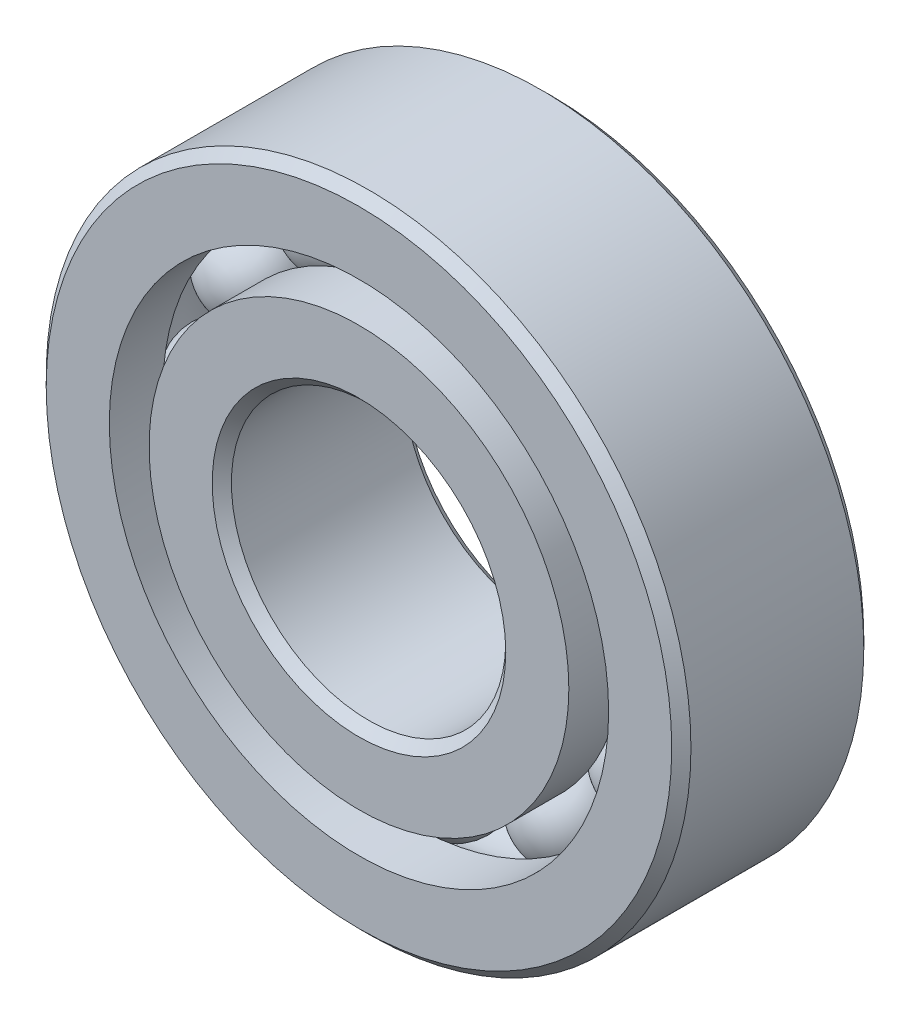
ISO-10303-21;
HEADER;
FILE_DESCRIPTION(('STEP AP214'),'2;1');
FILE_NAME('part.step','',(''),(''),'','','');
FILE_SCHEMA(('AUTOMOTIVE_DESIGN { 1 0 10303 214 1 1 1 1 }'));
ENDSEC;
DATA;
#1=APPLICATION_CONTEXT('core data for automotive mechanical design processes');
#2=APPLICATION_PROTOCOL_DEFINITION('international standard','automotive_design',2000,#1);
#3=PRODUCT_CONTEXT('',#1,'mechanical');
#4=PRODUCT('Part','Part','',(#3));
#5=PRODUCT_RELATED_PRODUCT_CATEGORY('part','',(#4));
#6=PRODUCT_DEFINITION_FORMATION('','',#4);
#7=PRODUCT_DEFINITION_CONTEXT('part definition',#1,'design');
#8=PRODUCT_DEFINITION('design','',#6,#7);
#9=PRODUCT_DEFINITION_SHAPE('','',#8);
#10=(LENGTH_UNIT() NAMED_UNIT(*) SI_UNIT(.MILLI.,.METRE.));
#11=(NAMED_UNIT(*) PLANE_ANGLE_UNIT() SI_UNIT($,.RADIAN.));
#12=(NAMED_UNIT(*) SI_UNIT($,.STERADIAN.) SOLID_ANGLE_UNIT());
#13=UNCERTAINTY_MEASURE_WITH_UNIT(LENGTH_MEASURE(1.E-05),#10,'distance_accuracy_value','');
#14=(GEOMETRIC_REPRESENTATION_CONTEXT(3) GLOBAL_UNCERTAINTY_ASSIGNED_CONTEXT((#13)) GLOBAL_UNIT_ASSIGNED_CONTEXT((#10,
#11,#12)) REPRESENTATION_CONTEXT('',''));
#15=CARTESIAN_POINT('',(0.,0.,0.));
#16=DIRECTION('',(0.,0.,1.));
#17=DIRECTION('',(1.,0.,0.));
#18=AXIS2_PLACEMENT_3D('',#15,#16,#17);
#19=CARTESIAN_POINT('',(-8.37499999999982,14.5059255133895,0.));
#20=DIRECTION('',(0.,0.,1.));
#21=DIRECTION('',(-0.499999999999989,0.866025403784445,0.));
#22=AXIS2_PLACEMENT_3D('',#19,#20,#21);
#23=SPHERICAL_SURFACE('',#22,3.43265291781274);
#24=CARTESIAN_POINT('',(-8.37499999999982,14.5059255133895,3.43265291781274));
#25=VERTEX_POINT('',#24);
#26=VERTEX_LOOP('',#25);
#27=FACE_BOUND('',#26,.T.);
#28=ADVANCED_FACE('F39',(#27),#23,.T.);
#29=CLOSED_SHELL('',(#28));
#30=MANIFOLD_SOLID_BREP('B2',#29);
#31=CARTESIAN_POINT('',(-14.5059255133893,8.37500000000017,0.));
#32=DIRECTION('',(0.,0.,1.));
#33=DIRECTION('',(-0.866025403784433,0.50000000000001,0.));
#34=AXIS2_PLACEMENT_3D('',#31,#32,#33);
#35=SPHERICAL_SURFACE('',#34,3.43265291781274);
#36=CARTESIAN_POINT('',(-14.5059255133893,8.37500000000017,3.43265291781274));
#37=VERTEX_POINT('',#36);
#38=VERTEX_LOOP('',#37);
#39=FACE_BOUND('',#38,.T.);
#40=ADVANCED_FACE('F59',(#39),#35,.T.);
#41=CLOSED_SHELL('',(#40));
#42=MANIFOLD_SOLID_BREP('B6',#41);
#43=CARTESIAN_POINT('',(-16.75,1.75446937276867E-13,0.));
#44=DIRECTION('',(0.,0.,1.));
#45=DIRECTION('',(-1.,0.,0.));
#46=AXIS2_PLACEMENT_3D('',#43,#44,#45);
#47=SPHERICAL_SURFACE('',#46,3.43265291781274);
#48=CARTESIAN_POINT('',(-16.75,1.75446937276867E-13,3.43265291781274));
#49=VERTEX_POINT('',#48);
#50=VERTEX_LOOP('',#49);
#51=FACE_BOUND('',#50,.T.);
#52=ADVANCED_FACE('F79',(#51),#47,.T.);
#53=CLOSED_SHELL('',(#52));
#54=MANIFOLD_SOLID_BREP('B35',#53);
#55=CARTESIAN_POINT('',(-14.5059255133894,-8.37499999999986,0.));
#56=DIRECTION('',(0.,0.,1.));
#57=DIRECTION('',(-0.866025403784443,-0.499999999999992,0.));
#58=AXIS2_PLACEMENT_3D('',#55,#56,#57);
#59=SPHERICAL_SURFACE('',#58,3.43265291781274);
#60=CARTESIAN_POINT('',(-14.5059255133894,-8.37499999999986,3.43265291781274));
#61=VERTEX_POINT('',#60);
#62=VERTEX_LOOP('',#61);
#63=FACE_BOUND('',#62,.T.);
#64=ADVANCED_FACE('F99',(#63),#59,.T.);
#65=CLOSED_SHELL('',(#64));
#66=MANIFOLD_SOLID_BREP('B55',#65);
#67=CARTESIAN_POINT('',(-8.37500000000012,-14.5059255133893,0.));
#68=DIRECTION('',(0.,0.,1.));
#69=DIRECTION('',(-0.500000000000007,-0.866025403784435,0.));
#70=AXIS2_PLACEMENT_3D('',#67,#68,#69);
#71=SPHERICAL_SURFACE('',#70,3.43265291781274);
#72=CARTESIAN_POINT('',(-8.37500000000012,-14.5059255133893,3.43265291781274));
#73=VERTEX_POINT('',#72);
#74=VERTEX_LOOP('',#73);
#75=FACE_BOUND('',#74,.T.);
#76=ADVANCED_FACE('F119',(#75),#71,.T.);
#77=CLOSED_SHELL('',(#76));
#78=MANIFOLD_SOLID_BREP('B75',#77);
#79=CARTESIAN_POINT('',(-1.16964624851245E-13,-16.75,0.));
#80=DIRECTION('',(0.,0.,1.));
#81=DIRECTION('',(0.,-1.,0.));
#82=AXIS2_PLACEMENT_3D('',#79,#80,#81);
#83=SPHERICAL_SURFACE('',#82,3.43265291781274);
#84=CARTESIAN_POINT('',(-1.16964624851245E-13,-16.75,3.43265291781274));
#85=VERTEX_POINT('',#84);
#86=VERTEX_LOOP('',#85);
#87=FACE_BOUND('',#86,.T.);
#88=ADVANCED_FACE('F139',(#87),#83,.T.);
#89=CLOSED_SHELL('',(#88));
#90=MANIFOLD_SOLID_BREP('B95',#89);
#91=CARTESIAN_POINT('',(8.37499999999991,-14.5059255133894,0.));
#92=DIRECTION('',(0.,0.,1.));
#93=DIRECTION('',(0.499999999999995,-0.866025403784442,0.));
#94=AXIS2_PLACEMENT_3D('',#91,#92,#93);
#95=SPHERICAL_SURFACE('',#94,3.43265291781274);
#96=CARTESIAN_POINT('',(8.37499999999991,-14.5059255133894,3.43265291781274));
#97=VERTEX_POINT('',#96);
#98=VERTEX_LOOP('',#97);
#99=FACE_BOUND('',#98,.T.);
#100=ADVANCED_FACE('F159',(#99),#95,.T.);
#101=CLOSED_SHELL('',(#100));
#102=MANIFOLD_SOLID_BREP('B115',#101);
#103=CARTESIAN_POINT('',(14.5059255133893,-8.37500000000007,0.));
#104=DIRECTION('',(0.,0.,1.));
#105=DIRECTION('',(0.866025403784436,-0.500000000000004,0.));
#106=AXIS2_PLACEMENT_3D('',#103,#104,#105);
#107=SPHERICAL_SURFACE('',#106,3.43265291781274);
#108=CARTESIAN_POINT('',(14.5059255133893,-8.37500000000007,3.43265291781274));
#109=VERTEX_POINT('',#108);
#110=VERTEX_LOOP('',#109);
#111=FACE_BOUND('',#110,.T.);
#112=ADVANCED_FACE('F179',(#111),#107,.T.);
#113=CLOSED_SHELL('',(#112));
#114=MANIFOLD_SOLID_BREP('B135',#113);
#115=CARTESIAN_POINT('',(16.75,0.,0.));
#116=DIRECTION('',(0.,0.,1.));
#117=DIRECTION('',(1.,0.,0.));
#118=AXIS2_PLACEMENT_3D('',#115,#116,#117);
#119=SPHERICAL_SURFACE('',#118,3.43265291781274);
#120=CARTESIAN_POINT('',(16.75,0.,3.43265291781274));
#121=VERTEX_POINT('',#120);
#122=VERTEX_LOOP('',#121);
#123=FACE_BOUND('',#122,.T.);
#124=ADVANCED_FACE('F199',(#123),#119,.T.);
#125=CLOSED_SHELL('',(#124));
#126=MANIFOLD_SOLID_BREP('B155',#125);
#127=CARTESIAN_POINT('',(14.5059255133894,8.37499999999997,0.));
#128=DIRECTION('',(0.,0.,1.));
#129=DIRECTION('',(0.86602540378444,0.499999999999998,0.));
#130=AXIS2_PLACEMENT_3D('',#127,#128,#129);
#131=SPHERICAL_SURFACE('',#130,3.43265291781274);
#132=CARTESIAN_POINT('',(14.5059255133894,8.37499999999997,3.43265291781274));
#133=VERTEX_POINT('',#132);
#134=VERTEX_LOOP('',#133);
#135=FACE_BOUND('',#134,.T.);
#136=ADVANCED_FACE('F219',(#135),#131,.T.);
#137=CLOSED_SHELL('',(#136));
#138=MANIFOLD_SOLID_BREP('B175',#137);
#139=CARTESIAN_POINT('',(8.37500000000002,14.5059255133893,0.));
#140=DIRECTION('',(0.,0.,1.));
#141=DIRECTION('',(0.500000000000001,0.866025403784438,0.));
#142=AXIS2_PLACEMENT_3D('',#139,#140,#141);
#143=SPHERICAL_SURFACE('',#142,3.43265291781274);
#144=CARTESIAN_POINT('',(8.37500000000002,14.5059255133893,3.43265291781274));
#145=VERTEX_POINT('',#144);
#146=VERTEX_LOOP('',#145);
#147=FACE_BOUND('',#146,.T.);
#148=ADVANCED_FACE('F239',(#147),#143,.T.);
#149=CLOSED_SHELL('',(#148));
#150=MANIFOLD_SOLID_BREP('B195',#149);
#151=CARTESIAN_POINT('',(0.,16.75,0.));
#152=DIRECTION('',(0.,0.,1.));
#153=DIRECTION('',(0.,1.,0.));
#154=AXIS2_PLACEMENT_3D('',#151,#152,#153);
#155=SPHERICAL_SURFACE('',#154,3.43265291781274);
#156=CARTESIAN_POINT('',(0.,16.75,3.43265291781274));
#157=VERTEX_POINT('',#156);
#158=VERTEX_LOOP('',#157);
#159=FACE_BOUND('',#158,.T.);
#160=ADVANCED_FACE('F261',(#159),#155,.T.);
#161=CLOSED_SHELL('',(#160));
#162=MANIFOLD_SOLID_BREP('B215',#161);
#163=CARTESIAN_POINT('',(0.,15.2994505494506,7.));
#164=DIRECTION('',(0.,0.,-1.));
#165=DIRECTION('',(-1.,0.,0.));
#166=AXIS2_PLACEMENT_3D('',#163,#164,#165);
#167=PLANE('',#166);
#168=CARTESIAN_POINT('',(0.,0.,7.));
#169=DIRECTION('',(0.,0.,1.));
#170=DIRECTION('',(1.,0.,0.));
#171=AXIS2_PLACEMENT_3D('',#168,#169,#170);
#172=CIRCLE('',#171,10.7);
#173=CARTESIAN_POINT('',(10.7,0.,7.));
#174=VERTEX_POINT('',#173);
#175=EDGE_CURVE('E308',#174,#174,#172,.T.);
#176=ORIENTED_EDGE('',*,*,#175,.F.);
#177=EDGE_LOOP('',(#176));
#178=FACE_BOUND('',#177,.T.);
#179=CARTESIAN_POINT('',(0.,0.,7.));
#180=DIRECTION('',(0.,0.,1.));
#181=DIRECTION('',(1.,0.,0.));
#182=AXIS2_PLACEMENT_3D('',#179,#180,#181);
#183=CIRCLE('',#182,15.2994505494506);
#184=CARTESIAN_POINT('',(15.2994505494506,0.,7.));
#185=VERTEX_POINT('',#184);
#186=EDGE_CURVE('E260',#185,#185,#183,.T.);
#187=ORIENTED_EDGE('',*,*,#186,.T.);
#188=EDGE_LOOP('',(#187));
#189=FACE_BOUND('',#188,.T.);
#190=ADVANCED_FACE('F280',(#178,#189),#167,.F.);
#191=CARTESIAN_POINT('',(0.,0.,7.));
#192=DIRECTION('',(0.,0.,1.));
#193=DIRECTION('',(1.,0.,0.));
#194=AXIS2_PLACEMENT_3D('',#191,#192,#193);
#195=CYLINDRICAL_SURFACE('',#194,15.2994505494506);
#196=ORIENTED_EDGE('',*,*,#186,.F.);
#197=EDGE_LOOP('',(#196));
#198=FACE_BOUND('',#197,.T.);
#199=CARTESIAN_POINT('',(0.,0.,3.11111111111111));
#200=DIRECTION('',(0.,0.,1.));
#201=DIRECTION('',(1.,0.,0.));
#202=AXIS2_PLACEMENT_3D('',#199,#200,#201);
#203=CIRCLE('',#202,15.2994505494506);
#204=CARTESIAN_POINT('',(15.2994505494506,0.,3.11111111111111));
#205=VERTEX_POINT('',#204);
#206=EDGE_CURVE('E286',#205,#205,#203,.T.);
#207=ORIENTED_EDGE('',*,*,#206,.T.);
#208=EDGE_LOOP('',(#207));
#209=FACE_BOUND('',#208,.T.);
#210=ADVANCED_FACE('F315',(#198,#209),#195,.T.);
#211=CARTESIAN_POINT('',(0.,0.,0.));
#212=DIRECTION('',(0.,0.,1.));
#213=DIRECTION('',(1.,0.,0.));
#214=AXIS2_PLACEMENT_3D('',#211,#212,#213);
#215=TOROIDAL_SURFACE('',#214,16.75,3.43265291781274);
#216=ORIENTED_EDGE('',*,*,#206,.F.);
#217=EDGE_LOOP('',(#216));
#218=FACE_BOUND('',#217,.T.);
#219=CARTESIAN_POINT('',(0.,0.,-3.11111111111112));
#220=DIRECTION('',(0.,0.,1.));
#221=DIRECTION('',(1.,0.,0.));
#222=AXIS2_PLACEMENT_3D('',#219,#220,#221);
#223=CIRCLE('',#222,15.2994505494505);
#224=CARTESIAN_POINT('',(15.2994505494505,0.,-3.11111111111112));
#225=VERTEX_POINT('',#224);
#226=EDGE_CURVE('E290',#225,#225,#223,.T.);
#227=ORIENTED_EDGE('',*,*,#226,.T.);
#228=EDGE_LOOP('',(#227));
#229=FACE_BOUND('',#228,.T.);
#230=ADVANCED_FACE('F319',(#218,#229),#215,.F.);
#231=CARTESIAN_POINT('',(0.,0.,7.));
#232=DIRECTION('',(0.,0.,1.));
#233=DIRECTION('',(1.,0.,0.));
#234=AXIS2_PLACEMENT_3D('',#231,#232,#233);
#235=CYLINDRICAL_SURFACE('',#234,15.2994505494506);
#236=ORIENTED_EDGE('',*,*,#226,.F.);
#237=EDGE_LOOP('',(#236));
#238=FACE_BOUND('',#237,.T.);
#239=CARTESIAN_POINT('',(0.,0.,-7.));
#240=DIRECTION('',(0.,0.,1.));
#241=DIRECTION('',(1.,0.,0.));
#242=AXIS2_PLACEMENT_3D('',#239,#240,#241);
#243=CIRCLE('',#242,15.2994505494506);
#244=CARTESIAN_POINT('',(15.2994505494506,0.,-7.));
#245=VERTEX_POINT('',#244);
#246=EDGE_CURVE('E294',#245,#245,#243,.T.);
#247=ORIENTED_EDGE('',*,*,#246,.T.);
#248=EDGE_LOOP('',(#247));
#249=FACE_BOUND('',#248,.T.);
#250=ADVANCED_FACE('F324',(#238,#249),#235,.T.);
#251=CARTESIAN_POINT('',(0.,10.7,-7.));
#252=DIRECTION('',(0.,0.,1.));
#253=DIRECTION('',(1.,0.,0.));
#254=AXIS2_PLACEMENT_3D('',#251,#252,#253);
#255=PLANE('',#254);
#256=ORIENTED_EDGE('',*,*,#246,.F.);
#257=EDGE_LOOP('',(#256));
#258=FACE_BOUND('',#257,.T.);
#259=CARTESIAN_POINT('',(0.,0.,-7.));
#260=DIRECTION('',(0.,0.,1.));
#261=DIRECTION('',(1.,0.,0.));
#262=AXIS2_PLACEMENT_3D('',#259,#260,#261);
#263=CIRCLE('',#262,10.7);
#264=CARTESIAN_POINT('',(10.7,0.,-7.));
#265=VERTEX_POINT('',#264);
#266=EDGE_CURVE('E299',#265,#265,#263,.T.);
#267=ORIENTED_EDGE('',*,*,#266,.T.);
#268=EDGE_LOOP('',(#267));
#269=FACE_BOUND('',#268,.T.);
#270=ADVANCED_FACE('F330',(#258,#269),#255,.F.);
#271=CARTESIAN_POINT('',(0.,0.,-6.3));
#272=DIRECTION('',(0.,0.,-1.));
#273=DIRECTION('',(-1.,0.,0.));
#274=AXIS2_PLACEMENT_3D('',#271,#272,#273);
#275=CONICAL_SURFACE('',#274,10.,0.78539816339745);
#276=ORIENTED_EDGE('',*,*,#266,.F.);
#277=EDGE_LOOP('',(#276));
#278=FACE_BOUND('',#277,.T.);
#279=CARTESIAN_POINT('',(0.,0.,-6.3));
#280=DIRECTION('',(0.,0.,1.));
#281=DIRECTION('',(1.,0.,0.));
#282=AXIS2_PLACEMENT_3D('',#279,#280,#281);
#283=CIRCLE('',#282,10.);
#284=CARTESIAN_POINT('',(10.,0.,-6.3));
#285=VERTEX_POINT('',#284);
#286=EDGE_CURVE('E302',#285,#285,#283,.T.);
#287=ORIENTED_EDGE('',*,*,#286,.T.);
#288=EDGE_LOOP('',(#287));
#289=FACE_BOUND('',#288,.T.);
#290=ADVANCED_FACE('F334',(#278,#289),#275,.F.);
#291=CARTESIAN_POINT('',(0.,0.,7.));
#292=DIRECTION('',(0.,0.,1.));
#293=DIRECTION('',(1.,0.,0.));
#294=AXIS2_PLACEMENT_3D('',#291,#292,#293);
#295=CYLINDRICAL_SURFACE('',#294,10.);
#296=ORIENTED_EDGE('',*,*,#286,.F.);
#297=EDGE_LOOP('',(#296));
#298=FACE_BOUND('',#297,.T.);
#299=CARTESIAN_POINT('',(0.,0.,6.3));
#300=DIRECTION('',(0.,0.,1.));
#301=DIRECTION('',(1.,0.,0.));
#302=AXIS2_PLACEMENT_3D('',#299,#300,#301);
#303=CIRCLE('',#302,10.);
#304=CARTESIAN_POINT('',(10.,0.,6.3));
#305=VERTEX_POINT('',#304);
#306=EDGE_CURVE('E305',#305,#305,#303,.T.);
#307=ORIENTED_EDGE('',*,*,#306,.T.);
#308=EDGE_LOOP('',(#307));
#309=FACE_BOUND('',#308,.T.);
#310=ADVANCED_FACE('F338',(#298,#309),#295,.F.);
#311=CARTESIAN_POINT('',(0.,0.,7.));
#312=DIRECTION('',(0.,0.,1.));
#313=DIRECTION('',(1.,0.,0.));
#314=AXIS2_PLACEMENT_3D('',#311,#312,#313);
#315=CONICAL_SURFACE('',#314,10.7,0.785398163397445);
#316=ORIENTED_EDGE('',*,*,#306,.F.);
#317=EDGE_LOOP('',(#316));
#318=FACE_BOUND('',#317,.T.);
#319=ORIENTED_EDGE('',*,*,#175,.T.);
#320=EDGE_LOOP('',(#319));
#321=FACE_BOUND('',#320,.T.);
#322=ADVANCED_FACE('F312',(#318,#321),#315,.F.);
#323=CLOSED_SHELL('',(#190,#210,#230,#250,#270,#290,#310,#322));
#324=MANIFOLD_SOLID_BREP('B235',#323);
#325=CARTESIAN_POINT('',(0.,0.,6.3));
#326=DIRECTION('',(0.,0.,-1.));
#327=DIRECTION('',(-1.,0.,0.));
#328=AXIS2_PLACEMENT_3D('',#325,#326,#327);
#329=CONICAL_SURFACE('',#328,23.5,0.785398163397448);
#330=CARTESIAN_POINT('',(0.,0.,7.));
#331=DIRECTION('',(0.,0.,1.));
#332=DIRECTION('',(1.,0.,0.));
#333=AXIS2_PLACEMENT_3D('',#330,#331,#332);
#334=CIRCLE('',#333,22.8);
#335=CARTESIAN_POINT('',(22.8,0.,7.));
#336=VERTEX_POINT('',#335);
#337=EDGE_CURVE('E429',#336,#336,#334,.T.);
#338=ORIENTED_EDGE('',*,*,#337,.F.);
#339=EDGE_LOOP('',(#338));
#340=FACE_BOUND('',#339,.T.);
#341=CARTESIAN_POINT('',(0.,0.,6.3));
#342=DIRECTION('',(0.,0.,1.));
#343=DIRECTION('',(1.,0.,0.));
#344=AXIS2_PLACEMENT_3D('',#341,#342,#343);
#345=CIRCLE('',#344,23.5);
#346=CARTESIAN_POINT('',(23.5,0.,6.3));
#347=VERTEX_POINT('',#346);
#348=EDGE_CURVE('E279',#347,#347,#345,.T.);
#349=ORIENTED_EDGE('',*,*,#348,.T.);
#350=EDGE_LOOP('',(#349));
#351=FACE_BOUND('',#350,.T.);
#352=ADVANCED_FACE('F401',(#340,#351),#329,.T.);
#353=CARTESIAN_POINT('',(0.,0.,7.));
#354=DIRECTION('',(0.,0.,1.));
#355=DIRECTION('',(1.,0.,0.));
#356=AXIS2_PLACEMENT_3D('',#353,#354,#355);
#357=CYLINDRICAL_SURFACE('',#356,23.5);
#358=ORIENTED_EDGE('',*,*,#348,.F.);
#359=EDGE_LOOP('',(#358));
#360=FACE_BOUND('',#359,.T.);
#361=CARTESIAN_POINT('',(0.,0.,-6.3));
#362=DIRECTION('',(0.,0.,1.));
#363=DIRECTION('',(1.,0.,0.));
#364=AXIS2_PLACEMENT_3D('',#361,#362,#363);
#365=CIRCLE('',#364,23.5);
#366=CARTESIAN_POINT('',(23.5,0.,-6.3));
#367=VERTEX_POINT('',#366);
#368=EDGE_CURVE('E407',#367,#367,#365,.T.);
#369=ORIENTED_EDGE('',*,*,#368,.T.);
#370=EDGE_LOOP('',(#369));
#371=FACE_BOUND('',#370,.T.);
#372=ADVANCED_FACE('F436',(#360,#371),#357,.T.);
#373=CARTESIAN_POINT('',(0.,0.,-7.));
#374=DIRECTION('',(0.,0.,1.));
#375=DIRECTION('',(1.,0.,0.));
#376=AXIS2_PLACEMENT_3D('',#373,#374,#375);
#377=CONICAL_SURFACE('',#376,22.8,0.785398163397448);
#378=ORIENTED_EDGE('',*,*,#368,.F.);
#379=EDGE_LOOP('',(#378));
#380=FACE_BOUND('',#379,.T.);
#381=CARTESIAN_POINT('',(0.,0.,-7.));
#382=DIRECTION('',(0.,0.,1.));
#383=DIRECTION('',(1.,0.,0.));
#384=AXIS2_PLACEMENT_3D('',#381,#382,#383);
#385=CIRCLE('',#384,22.8);
#386=CARTESIAN_POINT('',(22.8,0.,-7.));
#387=VERTEX_POINT('',#386);
#388=EDGE_CURVE('E411',#387,#387,#385,.T.);
#389=ORIENTED_EDGE('',*,*,#388,.T.);
#390=EDGE_LOOP('',(#389));
#391=FACE_BOUND('',#390,.T.);
#392=ADVANCED_FACE('F440',(#380,#391),#377,.T.);
#393=CARTESIAN_POINT('',(0.,22.8,-7.));
#394=DIRECTION('',(0.,0.,1.));
#395=DIRECTION('',(1.,0.,0.));
#396=AXIS2_PLACEMENT_3D('',#393,#394,#395);
#397=PLANE('',#396);
#398=ORIENTED_EDGE('',*,*,#388,.F.);
#399=EDGE_LOOP('',(#398));
#400=FACE_BOUND('',#399,.T.);
#401=CARTESIAN_POINT('',(0.,0.,-7.00000000000001));
#402=DIRECTION('',(0.,0.,1.));
#403=DIRECTION('',(1.,0.,0.));
#404=AXIS2_PLACEMENT_3D('',#401,#402,#403);
#405=CIRCLE('',#404,18.2005494505494);
#406=CARTESIAN_POINT('',(18.2005494505494,0.,-7.00000000000001));
#407=VERTEX_POINT('',#406);
#408=EDGE_CURVE('E415',#407,#407,#405,.T.);
#409=ORIENTED_EDGE('',*,*,#408,.T.);
#410=EDGE_LOOP('',(#409));
#411=FACE_BOUND('',#410,.T.);
#412=ADVANCED_FACE('F445',(#400,#411),#397,.F.);
#413=CARTESIAN_POINT('',(0.,0.,7.));
#414=DIRECTION('',(0.,0.,1.));
#415=DIRECTION('',(1.,0.,0.));
#416=AXIS2_PLACEMENT_3D('',#413,#414,#415);
#417=CYLINDRICAL_SURFACE('',#416,18.2005494505494);
#418=ORIENTED_EDGE('',*,*,#408,.F.);
#419=EDGE_LOOP('',(#418));
#420=FACE_BOUND('',#419,.T.);
#421=CARTESIAN_POINT('',(0.,0.,-3.11111111111111));
#422=DIRECTION('',(0.,0.,1.));
#423=DIRECTION('',(1.,0.,0.));
#424=AXIS2_PLACEMENT_3D('',#421,#422,#423);
#425=CIRCLE('',#424,18.2005494505494);
#426=CARTESIAN_POINT('',(18.2005494505494,0.,-3.11111111111111));
#427=VERTEX_POINT('',#426);
#428=EDGE_CURVE('E420',#427,#427,#425,.T.);
#429=ORIENTED_EDGE('',*,*,#428,.T.);
#430=EDGE_LOOP('',(#429));
#431=FACE_BOUND('',#430,.T.);
#432=ADVANCED_FACE('F451',(#420,#431),#417,.F.);
#433=CARTESIAN_POINT('',(0.,0.,0.));
#434=DIRECTION('',(0.,0.,1.));
#435=DIRECTION('',(1.,0.,0.));
#436=AXIS2_PLACEMENT_3D('',#433,#434,#435);
#437=TOROIDAL_SURFACE('',#436,16.75,3.43265291781274);
#438=ORIENTED_EDGE('',*,*,#428,.F.);
#439=EDGE_LOOP('',(#438));
#440=FACE_BOUND('',#439,.T.);
#441=CARTESIAN_POINT('',(0.,0.,3.11111111111111));
#442=DIRECTION('',(0.,0.,1.));
#443=DIRECTION('',(1.,0.,0.));
#444=AXIS2_PLACEMENT_3D('',#441,#442,#443);
#445=CIRCLE('',#444,18.2005494505494);
#446=CARTESIAN_POINT('',(18.2005494505494,0.,3.11111111111111));
#447=VERTEX_POINT('',#446);
#448=EDGE_CURVE('E423',#447,#447,#445,.T.);
#449=ORIENTED_EDGE('',*,*,#448,.T.);
#450=EDGE_LOOP('',(#449));
#451=FACE_BOUND('',#450,.T.);
#452=ADVANCED_FACE('F455',(#440,#451),#437,.F.);
#453=CARTESIAN_POINT('',(0.,0.,7.));
#454=DIRECTION('',(0.,0.,1.));
#455=DIRECTION('',(1.,0.,0.));
#456=AXIS2_PLACEMENT_3D('',#453,#454,#455);
#457=CYLINDRICAL_SURFACE('',#456,18.2005494505494);
#458=ORIENTED_EDGE('',*,*,#448,.F.);
#459=EDGE_LOOP('',(#458));
#460=FACE_BOUND('',#459,.T.);
#461=CARTESIAN_POINT('',(0.,0.,7.));
#462=DIRECTION('',(0.,0.,1.));
#463=DIRECTION('',(1.,0.,0.));
#464=AXIS2_PLACEMENT_3D('',#461,#462,#463);
#465=CIRCLE('',#464,18.2005494505494);
#466=CARTESIAN_POINT('',(18.2005494505494,0.,7.));
#467=VERTEX_POINT('',#466);
#468=EDGE_CURVE('E426',#467,#467,#465,.T.);
#469=ORIENTED_EDGE('',*,*,#468,.T.);
#470=EDGE_LOOP('',(#469));
#471=FACE_BOUND('',#470,.T.);
#472=ADVANCED_FACE('F459',(#460,#471),#457,.F.);
#473=CARTESIAN_POINT('',(0.,22.8,7.));
#474=DIRECTION('',(0.,0.,-1.));
#475=DIRECTION('',(-1.,0.,0.));
#476=AXIS2_PLACEMENT_3D('',#473,#474,#475);
#477=PLANE('',#476);
#478=ORIENTED_EDGE('',*,*,#468,.F.);
#479=EDGE_LOOP('',(#478));
#480=FACE_BOUND('',#479,.T.);
#481=ORIENTED_EDGE('',*,*,#337,.T.);
#482=EDGE_LOOP('',(#481));
#483=FACE_BOUND('',#482,.T.);
#484=ADVANCED_FACE('F433',(#480,#483),#477,.F.);
#485=CLOSED_SHELL('',(#352,#372,#392,#412,#432,#452,#472,#484));
#486=MANIFOLD_SOLID_BREP('B255',#485);
#487=ADVANCED_BREP_SHAPE_REPRESENTATION('',(#18,#30,#42,#54,#66,#78,#90,#102,#114,#126,#138,
#150,#162,#324,#486),#14);
#488=SHAPE_DEFINITION_REPRESENTATION(#9,#487);
ENDSEC;
END-ISO-10303-21;
